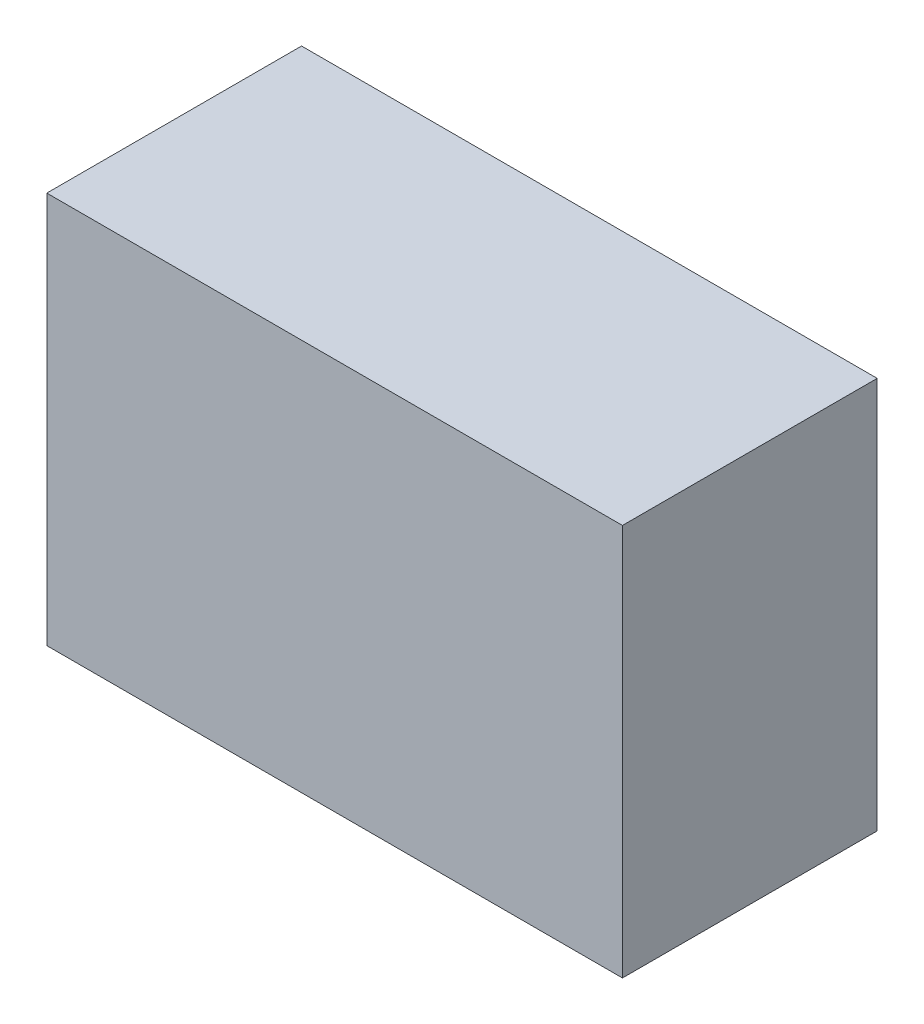
ISO-10303-21;
HEADER;
FILE_DESCRIPTION(('STEP AP214'),'2;1');
FILE_NAME('part.step','',(''),(''),'','','');
FILE_SCHEMA(('AUTOMOTIVE_DESIGN { 1 0 10303 214 1 1 1 1 }'));
ENDSEC;
DATA;
#1=APPLICATION_CONTEXT('core data for automotive mechanical design processes');
#2=APPLICATION_PROTOCOL_DEFINITION('international standard','automotive_design',2000,#1);
#3=PRODUCT_CONTEXT('',#1,'mechanical');
#4=PRODUCT('Part','Part','',(#3));
#5=PRODUCT_RELATED_PRODUCT_CATEGORY('part','',(#4));
#6=PRODUCT_DEFINITION_FORMATION('','',#4);
#7=PRODUCT_DEFINITION_CONTEXT('part definition',#1,'design');
#8=PRODUCT_DEFINITION('design','',#6,#7);
#9=PRODUCT_DEFINITION_SHAPE('','',#8);
#10=(LENGTH_UNIT() NAMED_UNIT(*) SI_UNIT(.MILLI.,.METRE.));
#11=(NAMED_UNIT(*) PLANE_ANGLE_UNIT() SI_UNIT($,.RADIAN.));
#12=(NAMED_UNIT(*) SI_UNIT($,.STERADIAN.) SOLID_ANGLE_UNIT());
#13=UNCERTAINTY_MEASURE_WITH_UNIT(LENGTH_MEASURE(1.E-05),#10,'distance_accuracy_value','');
#14=(GEOMETRIC_REPRESENTATION_CONTEXT(3) GLOBAL_UNCERTAINTY_ASSIGNED_CONTEXT((#13)) GLOBAL_UNIT_ASSIGNED_CONTEXT((#10,
#11,#12)) REPRESENTATION_CONTEXT('',''));
#15=CARTESIAN_POINT('',(0.,0.,0.));
#16=DIRECTION('',(0.,0.,1.));
#17=DIRECTION('',(1.,0.,0.));
#18=AXIS2_PLACEMENT_3D('',#15,#16,#17);
#19=CARTESIAN_POINT('',(-74.6125,101.6,-33.02));
#20=DIRECTION('',(1.,0.,0.));
#21=DIRECTION('',(0.,0.,-1.));
#22=AXIS2_PLACEMENT_3D('',#19,#20,#21);
#23=PLANE('',#22);
#24=DIRECTION('',(0.,0.,1.));
#25=VECTOR('',#24,1.);
#26=CARTESIAN_POINT('',(-74.6125,0.,-33.02));
#27=LINE('',#26,#25);
#28=CARTESIAN_POINT('',(-74.6125,0.,-33.02));
#29=VERTEX_POINT('',#28);
#30=CARTESIAN_POINT('',(-74.6125,0.,33.02));
#31=VERTEX_POINT('',#30);
#32=EDGE_CURVE('E94',#29,#31,#27,.T.);
#33=ORIENTED_EDGE('',*,*,#32,.T.);
#34=DIRECTION('',(0.,-1.,0.));
#35=VECTOR('',#34,1.);
#36=CARTESIAN_POINT('',(-74.6125,101.6,33.02));
#37=LINE('',#36,#35);
#38=CARTESIAN_POINT('',(-74.6125,101.6,33.02));
#39=VERTEX_POINT('',#38);
#40=EDGE_CURVE('E11',#39,#31,#37,.T.);
#41=ORIENTED_EDGE('',*,*,#40,.F.);
#42=DIRECTION('',(0.,0.,1.));
#43=VECTOR('',#42,1.);
#44=CARTESIAN_POINT('',(-74.6125,101.6,-33.02));
#45=LINE('',#44,#43);
#46=CARTESIAN_POINT('',(-74.6125,101.6,-33.02));
#47=VERTEX_POINT('',#46);
#48=EDGE_CURVE('E82',#47,#39,#45,.T.);
#49=ORIENTED_EDGE('',*,*,#48,.F.);
#50=DIRECTION('',(0.,-1.,0.));
#51=VECTOR('',#50,1.);
#52=CARTESIAN_POINT('',(-74.6125,101.6,-33.02));
#53=LINE('',#52,#51);
#54=EDGE_CURVE('E90',#47,#29,#53,.T.);
#55=ORIENTED_EDGE('',*,*,#54,.T.);
#56=EDGE_LOOP('',(#33,#41,#49,#55));
#57=FACE_BOUND('',#56,.T.);
#58=ADVANCED_FACE('F31',(#57),#23,.F.);
#59=CARTESIAN_POINT('',(-74.6125,101.6,33.02));
#60=DIRECTION('',(0.,0.,-1.));
#61=DIRECTION('',(-1.,0.,0.));
#62=AXIS2_PLACEMENT_3D('',#59,#60,#61);
#63=PLANE('',#62);
#64=DIRECTION('',(1.,0.,0.));
#65=VECTOR('',#64,1.);
#66=CARTESIAN_POINT('',(-74.6125,0.,33.02));
#67=LINE('',#66,#65);
#68=CARTESIAN_POINT('',(74.6125,0.,33.02));
#69=VERTEX_POINT('',#68);
#70=EDGE_CURVE('E86',#31,#69,#67,.T.);
#71=ORIENTED_EDGE('',*,*,#70,.T.);
#72=DIRECTION('',(0.,-1.,0.));
#73=VECTOR('',#72,1.);
#74=CARTESIAN_POINT('',(74.6125,101.6,33.02));
#75=LINE('',#74,#73);
#76=CARTESIAN_POINT('',(74.6125,101.6,33.02));
#77=VERTEX_POINT('',#76);
#78=EDGE_CURVE('E39',#77,#69,#75,.T.);
#79=ORIENTED_EDGE('',*,*,#78,.F.);
#80=DIRECTION('',(1.,0.,0.));
#81=VECTOR('',#80,1.);
#82=CARTESIAN_POINT('',(-74.6125,101.6,33.02));
#83=LINE('',#82,#81);
#84=EDGE_CURVE('E77',#39,#77,#83,.T.);
#85=ORIENTED_EDGE('',*,*,#84,.F.);
#86=ORIENTED_EDGE('',*,*,#40,.T.);
#87=EDGE_LOOP('',(#71,#79,#85,#86));
#88=FACE_BOUND('',#87,.T.);
#89=ADVANCED_FACE('F85',(#88),#63,.F.);
#90=CARTESIAN_POINT('',(74.6125,101.6,-33.02));
#91=DIRECTION('',(-1.,0.,0.));
#92=DIRECTION('',(0.,0.,1.));
#93=AXIS2_PLACEMENT_3D('',#90,#91,#92);
#94=PLANE('',#93);
#95=DIRECTION('',(0.,0.,-1.));
#96=VECTOR('',#95,1.);
#97=CARTESIAN_POINT('',(74.6125,0.,-33.02));
#98=LINE('',#97,#96);
#99=CARTESIAN_POINT('',(74.6125,0.,-33.02));
#100=VERTEX_POINT('',#99);
#101=EDGE_CURVE('E64',#69,#100,#98,.T.);
#102=ORIENTED_EDGE('',*,*,#101,.T.);
#103=DIRECTION('',(0.,-1.,0.));
#104=VECTOR('',#103,1.);
#105=CARTESIAN_POINT('',(74.6125,101.6,-33.02));
#106=LINE('',#105,#104);
#107=CARTESIAN_POINT('',(74.6125,101.6,-33.02));
#108=VERTEX_POINT('',#107);
#109=EDGE_CURVE('E87',#108,#100,#106,.T.);
#110=ORIENTED_EDGE('',*,*,#109,.F.);
#111=DIRECTION('',(0.,0.,-1.));
#112=VECTOR('',#111,1.);
#113=CARTESIAN_POINT('',(74.6125,101.6,-33.02));
#114=LINE('',#113,#112);
#115=EDGE_CURVE('E80',#77,#108,#114,.T.);
#116=ORIENTED_EDGE('',*,*,#115,.F.);
#117=ORIENTED_EDGE('',*,*,#78,.T.);
#118=EDGE_LOOP('',(#102,#110,#116,#117));
#119=FACE_BOUND('',#118,.T.);
#120=ADVANCED_FACE('F88',(#119),#94,.F.);
#121=CARTESIAN_POINT('',(-74.6125,101.6,-33.02));
#122=DIRECTION('',(0.,0.,1.));
#123=DIRECTION('',(1.,0.,0.));
#124=AXIS2_PLACEMENT_3D('',#121,#122,#123);
#125=PLANE('',#124);
#126=DIRECTION('',(-1.,0.,0.));
#127=VECTOR('',#126,1.);
#128=CARTESIAN_POINT('',(-74.6125,0.,-33.02));
#129=LINE('',#128,#127);
#130=EDGE_CURVE('E70',#100,#29,#129,.T.);
#131=ORIENTED_EDGE('',*,*,#130,.T.);
#132=ORIENTED_EDGE('',*,*,#54,.F.);
#133=DIRECTION('',(-1.,0.,0.));
#134=VECTOR('',#133,1.);
#135=CARTESIAN_POINT('',(-74.6125,101.6,-33.02));
#136=LINE('',#135,#134);
#137=EDGE_CURVE('E47',#108,#47,#136,.T.);
#138=ORIENTED_EDGE('',*,*,#137,.F.);
#139=ORIENTED_EDGE('',*,*,#109,.T.);
#140=EDGE_LOOP('',(#131,#132,#138,#139));
#141=FACE_BOUND('',#140,.T.);
#142=ADVANCED_FACE('F101',(#141),#125,.F.);
#143=CARTESIAN_POINT('',(-74.6125,101.6,33.02));
#144=DIRECTION('',(0.,1.,0.));
#145=DIRECTION('',(0.,0.,1.));
#146=AXIS2_PLACEMENT_3D('',#143,#144,#145);
#147=PLANE('',#146);
#148=ORIENTED_EDGE('',*,*,#48,.T.);
#149=ORIENTED_EDGE('',*,*,#84,.T.);
#150=ORIENTED_EDGE('',*,*,#115,.T.);
#151=ORIENTED_EDGE('',*,*,#137,.T.);
#152=EDGE_LOOP('',(#148,#149,#150,#151));
#153=FACE_BOUND('',#152,.T.);
#154=ADVANCED_FACE('F78',(#153),#147,.T.);
#155=CARTESIAN_POINT('',(-74.6125,0.,33.02));
#156=DIRECTION('',(0.,1.,0.));
#157=DIRECTION('',(0.,0.,1.));
#158=AXIS2_PLACEMENT_3D('',#155,#156,#157);
#159=PLANE('',#158);
#160=ORIENTED_EDGE('',*,*,#32,.F.);
#161=ORIENTED_EDGE('',*,*,#130,.F.);
#162=ORIENTED_EDGE('',*,*,#101,.F.);
#163=ORIENTED_EDGE('',*,*,#70,.F.);
#164=EDGE_LOOP('',(#160,#161,#162,#163));
#165=FACE_BOUND('',#164,.T.);
#166=ADVANCED_FACE('F104',(#165),#159,.F.);
#167=CLOSED_SHELL('',(#58,#89,#120,#142,#154,#166));
#168=MANIFOLD_SOLID_BREP('B2',#167);
#169=ADVANCED_BREP_SHAPE_REPRESENTATION('',(#18,#168),#14);
#170=SHAPE_DEFINITION_REPRESENTATION(#9,#169);
ENDSEC;
END-ISO-10303-21;
